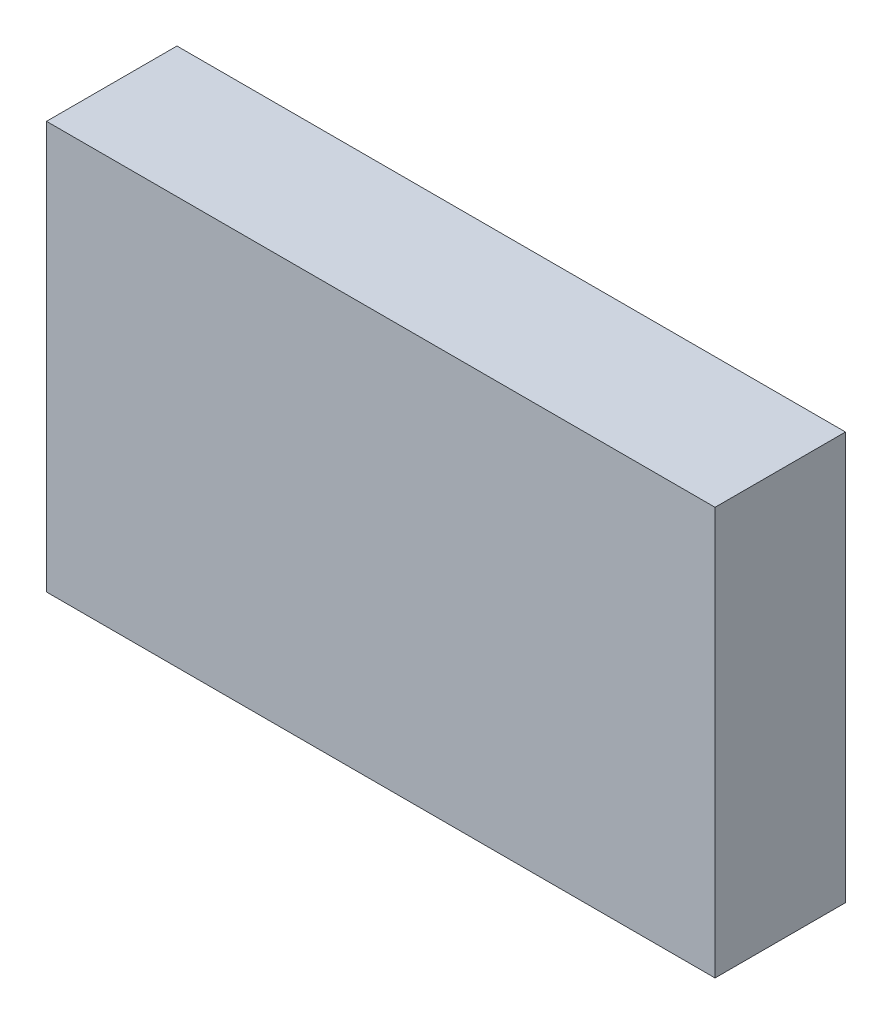
ISO-10303-21;
HEADER;
FILE_DESCRIPTION(('STEP AP214'),'2;1');
FILE_NAME('part.step','',(''),(''),'','','');
FILE_SCHEMA(('AUTOMOTIVE_DESIGN { 1 0 10303 214 1 1 1 1 }'));
ENDSEC;
DATA;
#1=APPLICATION_CONTEXT('core data for automotive mechanical design processes');
#2=APPLICATION_PROTOCOL_DEFINITION('international standard','automotive_design',2000,#1);
#3=PRODUCT_CONTEXT('',#1,'mechanical');
#4=PRODUCT('Part','Part','',(#3));
#5=PRODUCT_RELATED_PRODUCT_CATEGORY('part','',(#4));
#6=PRODUCT_DEFINITION_FORMATION('','',#4);
#7=PRODUCT_DEFINITION_CONTEXT('part definition',#1,'design');
#8=PRODUCT_DEFINITION('design','',#6,#7);
#9=PRODUCT_DEFINITION_SHAPE('','',#8);
#10=(LENGTH_UNIT() NAMED_UNIT(*) SI_UNIT(.MILLI.,.METRE.));
#11=(NAMED_UNIT(*) PLANE_ANGLE_UNIT() SI_UNIT($,.RADIAN.));
#12=(NAMED_UNIT(*) SI_UNIT($,.STERADIAN.) SOLID_ANGLE_UNIT());
#13=UNCERTAINTY_MEASURE_WITH_UNIT(LENGTH_MEASURE(1.E-05),#10,'distance_accuracy_value','');
#14=(GEOMETRIC_REPRESENTATION_CONTEXT(3) GLOBAL_UNCERTAINTY_ASSIGNED_CONTEXT((#13)) GLOBAL_UNIT_ASSIGNED_CONTEXT((#10,
#11,#12)) REPRESENTATION_CONTEXT('',''));
#15=CARTESIAN_POINT('',(0.,0.,0.));
#16=DIRECTION('',(0.,0.,1.));
#17=DIRECTION('',(1.,0.,0.));
#18=AXIS2_PLACEMENT_3D('',#15,#16,#17);
#19=CARTESIAN_POINT('',(206.906674027443,43.6904488131404,0.));
#20=DIRECTION('',(0.,1.,0.));
#21=DIRECTION('',(0.,0.,1.));
#22=AXIS2_PLACEMENT_3D('',#19,#20,#21);
#23=PLANE('',#22);
#24=DIRECTION('',(-1.,0.,0.));
#25=VECTOR('',#24,1.);
#26=CARTESIAN_POINT('',(206.906674027443,43.6904488131404,16.));
#27=LINE('',#26,#25);
#28=CARTESIAN_POINT('',(206.906674027443,43.6904488131404,16.));
#29=VERTEX_POINT('',#28);
#30=CARTESIAN_POINT('',(124.906674027443,43.6904488131404,16.));
#31=VERTEX_POINT('',#30);
#32=EDGE_CURVE('E97',#29,#31,#27,.T.);
#33=ORIENTED_EDGE('',*,*,#32,.F.);
#34=DIRECTION('',(0.,0.,1.));
#35=VECTOR('',#34,1.);
#36=CARTESIAN_POINT('',(206.906674027443,43.6904488131404,0.));
#37=LINE('',#36,#35);
#38=CARTESIAN_POINT('',(206.906674027443,43.6904488131404,0.));
#39=VERTEX_POINT('',#38);
#40=EDGE_CURVE('E11',#39,#29,#37,.T.);
#41=ORIENTED_EDGE('',*,*,#40,.F.);
#42=DIRECTION('',(-1.,0.,0.));
#43=VECTOR('',#42,1.);
#44=CARTESIAN_POINT('',(206.906674027443,43.6904488131404,0.));
#45=LINE('',#44,#43);
#46=CARTESIAN_POINT('',(124.906674027443,43.6904488131404,0.));
#47=VERTEX_POINT('',#46);
#48=EDGE_CURVE('E91',#39,#47,#45,.T.);
#49=ORIENTED_EDGE('',*,*,#48,.T.);
#50=DIRECTION('',(0.,0.,1.));
#51=VECTOR('',#50,1.);
#52=CARTESIAN_POINT('',(124.906674027443,43.6904488131404,0.));
#53=LINE('',#52,#51);
#54=EDGE_CURVE('E36',#47,#31,#53,.T.);
#55=ORIENTED_EDGE('',*,*,#54,.T.);
#56=EDGE_LOOP('',(#33,#41,#49,#55));
#57=FACE_BOUND('',#56,.T.);
#58=ADVANCED_FACE('F33',(#57),#23,.T.);
#59=CARTESIAN_POINT('',(206.906674027443,-6.30955118685961,0.));
#60=DIRECTION('',(1.,0.,0.));
#61=DIRECTION('',(0.,0.,-1.));
#62=AXIS2_PLACEMENT_3D('',#59,#60,#61);
#63=PLANE('',#62);
#64=DIRECTION('',(0.,1.,0.));
#65=VECTOR('',#64,1.);
#66=CARTESIAN_POINT('',(206.906674027443,-6.30955118685961,16.));
#67=LINE('',#66,#65);
#68=CARTESIAN_POINT('',(206.906674027443,-6.30955118685961,16.));
#69=VERTEX_POINT('',#68);
#70=EDGE_CURVE('E93',#69,#29,#67,.T.);
#71=ORIENTED_EDGE('',*,*,#70,.F.);
#72=DIRECTION('',(0.,0.,1.));
#73=VECTOR('',#72,1.);
#74=CARTESIAN_POINT('',(206.906674027443,-6.30955118685961,0.));
#75=LINE('',#74,#73);
#76=CARTESIAN_POINT('',(206.906674027443,-6.30955118685961,0.));
#77=VERTEX_POINT('',#76);
#78=EDGE_CURVE('E42',#77,#69,#75,.T.);
#79=ORIENTED_EDGE('',*,*,#78,.F.);
#80=DIRECTION('',(0.,1.,0.));
#81=VECTOR('',#80,1.);
#82=CARTESIAN_POINT('',(206.906674027443,-6.30955118685961,0.));
#83=LINE('',#82,#81);
#84=EDGE_CURVE('E88',#77,#39,#83,.T.);
#85=ORIENTED_EDGE('',*,*,#84,.T.);
#86=ORIENTED_EDGE('',*,*,#40,.T.);
#87=EDGE_LOOP('',(#71,#79,#85,#86));
#88=FACE_BOUND('',#87,.T.);
#89=ADVANCED_FACE('F107',(#88),#63,.T.);
#90=CARTESIAN_POINT('',(124.906674027443,-6.30955118685961,0.));
#91=DIRECTION('',(0.,-1.,0.));
#92=DIRECTION('',(0.,0.,-1.));
#93=AXIS2_PLACEMENT_3D('',#90,#91,#92);
#94=PLANE('',#93);
#95=DIRECTION('',(1.,0.,0.));
#96=VECTOR('',#95,1.);
#97=CARTESIAN_POINT('',(124.906674027443,-6.30955118685961,16.));
#98=LINE('',#97,#96);
#99=CARTESIAN_POINT('',(124.906674027443,-6.30955118685961,16.));
#100=VERTEX_POINT('',#99);
#101=EDGE_CURVE('E83',#100,#69,#98,.T.);
#102=ORIENTED_EDGE('',*,*,#101,.F.);
#103=DIRECTION('',(0.,0.,1.));
#104=VECTOR('',#103,1.);
#105=CARTESIAN_POINT('',(124.906674027443,-6.30955118685961,0.));
#106=LINE('',#105,#104);
#107=CARTESIAN_POINT('',(124.906674027443,-6.30955118685961,0.));
#108=VERTEX_POINT('',#107);
#109=EDGE_CURVE('E78',#108,#100,#106,.T.);
#110=ORIENTED_EDGE('',*,*,#109,.F.);
#111=DIRECTION('',(1.,0.,0.));
#112=VECTOR('',#111,1.);
#113=CARTESIAN_POINT('',(124.906674027443,-6.30955118685961,0.));
#114=LINE('',#113,#112);
#115=EDGE_CURVE('E81',#108,#77,#114,.T.);
#116=ORIENTED_EDGE('',*,*,#115,.T.);
#117=ORIENTED_EDGE('',*,*,#78,.T.);
#118=EDGE_LOOP('',(#102,#110,#116,#117));
#119=FACE_BOUND('',#118,.T.);
#120=ADVANCED_FACE('F80',(#119),#94,.T.);
#121=CARTESIAN_POINT('',(124.906674027443,43.6904488131404,0.));
#122=DIRECTION('',(-1.,0.,0.));
#123=DIRECTION('',(0.,0.,1.));
#124=AXIS2_PLACEMENT_3D('',#121,#122,#123);
#125=PLANE('',#124);
#126=DIRECTION('',(0.,-1.,0.));
#127=VECTOR('',#126,1.);
#128=CARTESIAN_POINT('',(124.906674027443,43.6904488131404,16.));
#129=LINE('',#128,#127);
#130=EDGE_CURVE('E100',#31,#100,#129,.T.);
#131=ORIENTED_EDGE('',*,*,#130,.F.);
#132=ORIENTED_EDGE('',*,*,#54,.F.);
#133=DIRECTION('',(0.,-1.,0.));
#134=VECTOR('',#133,1.);
#135=CARTESIAN_POINT('',(124.906674027443,43.6904488131404,0.));
#136=LINE('',#135,#134);
#137=EDGE_CURVE('E87',#47,#108,#136,.T.);
#138=ORIENTED_EDGE('',*,*,#137,.T.);
#139=ORIENTED_EDGE('',*,*,#109,.T.);
#140=EDGE_LOOP('',(#131,#132,#138,#139));
#141=FACE_BOUND('',#140,.T.);
#142=ADVANCED_FACE('F90',(#141),#125,.T.);
#143=CARTESIAN_POINT('',(0.,0.,0.));
#144=DIRECTION('',(0.,0.,1.));
#145=DIRECTION('',(1.,0.,0.));
#146=AXIS2_PLACEMENT_3D('',#143,#144,#145);
#147=PLANE('',#146);
#148=ORIENTED_EDGE('',*,*,#48,.F.);
#149=ORIENTED_EDGE('',*,*,#84,.F.);
#150=ORIENTED_EDGE('',*,*,#115,.F.);
#151=ORIENTED_EDGE('',*,*,#137,.F.);
#152=EDGE_LOOP('',(#148,#149,#150,#151));
#153=FACE_BOUND('',#152,.T.);
#154=ADVANCED_FACE('F86',(#153),#147,.F.);
#155=CARTESIAN_POINT('',(0.,0.,16.));
#156=DIRECTION('',(0.,0.,1.));
#157=DIRECTION('',(1.,0.,0.));
#158=AXIS2_PLACEMENT_3D('',#155,#156,#157);
#159=PLANE('',#158);
#160=ORIENTED_EDGE('',*,*,#32,.T.);
#161=ORIENTED_EDGE('',*,*,#130,.T.);
#162=ORIENTED_EDGE('',*,*,#101,.T.);
#163=ORIENTED_EDGE('',*,*,#70,.T.);
#164=EDGE_LOOP('',(#160,#161,#162,#163));
#165=FACE_BOUND('',#164,.T.);
#166=ADVANCED_FACE('F106',(#165),#159,.T.);
#167=CLOSED_SHELL('',(#58,#89,#120,#142,#154,#166));
#168=MANIFOLD_SOLID_BREP('B2',#167);
#169=ADVANCED_BREP_SHAPE_REPRESENTATION('',(#18,#168),#14);
#170=SHAPE_DEFINITION_REPRESENTATION(#9,#169);
ENDSEC;
END-ISO-10303-21;
